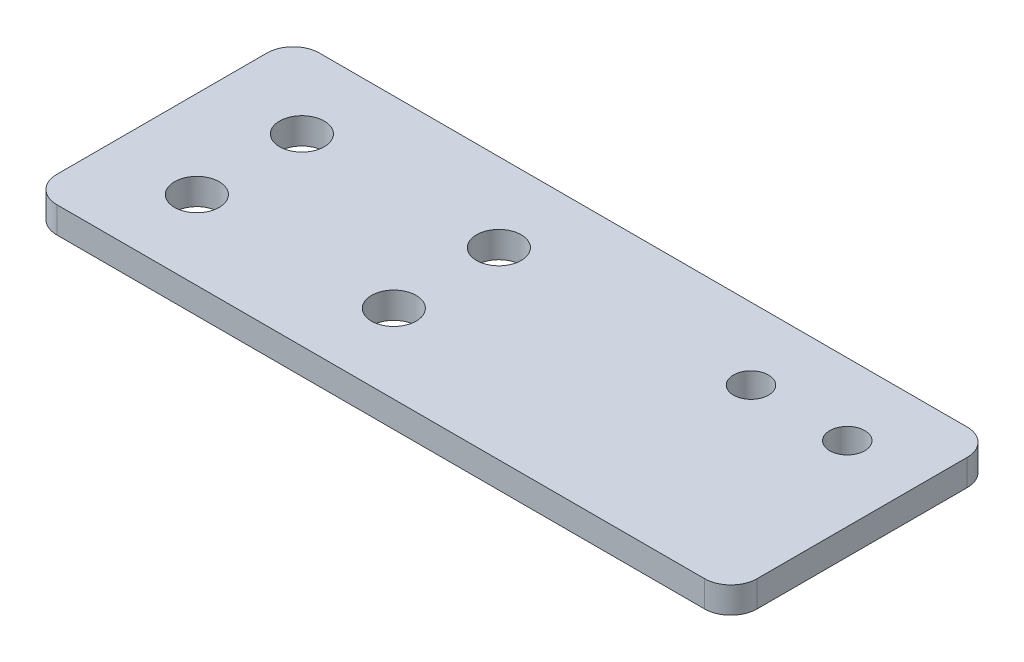
ISO-10303-21;
HEADER;
FILE_DESCRIPTION(('STEP AP214'),'2;1');
FILE_NAME('part.step','',(''),(''),'','','');
FILE_SCHEMA(('AUTOMOTIVE_DESIGN { 1 0 10303 214 1 1 1 1 }'));
ENDSEC;
DATA;
#1=APPLICATION_CONTEXT('core data for automotive mechanical design processes');
#2=APPLICATION_PROTOCOL_DEFINITION('international standard','automotive_design',2000,#1);
#3=PRODUCT_CONTEXT('',#1,'mechanical');
#4=PRODUCT('Part','Part','',(#3));
#5=PRODUCT_RELATED_PRODUCT_CATEGORY('part','',(#4));
#6=PRODUCT_DEFINITION_FORMATION('','',#4);
#7=PRODUCT_DEFINITION_CONTEXT('part definition',#1,'design');
#8=PRODUCT_DEFINITION('design','',#6,#7);
#9=PRODUCT_DEFINITION_SHAPE('','',#8);
#10=(LENGTH_UNIT() NAMED_UNIT(*) SI_UNIT(.MILLI.,.METRE.));
#11=(NAMED_UNIT(*) PLANE_ANGLE_UNIT() SI_UNIT($,.RADIAN.));
#12=(NAMED_UNIT(*) SI_UNIT($,.STERADIAN.) SOLID_ANGLE_UNIT());
#13=UNCERTAINTY_MEASURE_WITH_UNIT(LENGTH_MEASURE(1.E-05),#10,'distance_accuracy_value','');
#14=(GEOMETRIC_REPRESENTATION_CONTEXT(3) GLOBAL_UNCERTAINTY_ASSIGNED_CONTEXT((#13)) GLOBAL_UNIT_ASSIGNED_CONTEXT((#10,
#11,#12)) REPRESENTATION_CONTEXT('',''));
#15=CARTESIAN_POINT('',(0.,0.,0.));
#16=DIRECTION('',(0.,0.,1.));
#17=DIRECTION('',(1.,0.,0.));
#18=AXIS2_PLACEMENT_3D('',#15,#16,#17);
#19=CARTESIAN_POINT('',(37.,3.,-12.));
#20=DIRECTION('',(0.,1.,0.));
#21=DIRECTION('',(0.,0.,1.));
#22=AXIS2_PLACEMENT_3D('',#19,#20,#21);
#23=PLANE('',#22);
#24=CARTESIAN_POINT('',(-7.49999999999997,3.,-6.));
#25=DIRECTION('',(0.,1.,0.));
#26=DIRECTION('',(0.,0.,1.));
#27=AXIS2_PLACEMENT_3D('',#24,#25,#26);
#28=CIRCLE('',#27,2.55);
#29=CARTESIAN_POINT('',(-7.49999999999997,3.,-3.45));
#30=VERTEX_POINT('',#29);
#31=EDGE_CURVE('E202',#30,#30,#28,.T.);
#32=ORIENTED_EDGE('',*,*,#31,.F.);
#33=EDGE_LOOP('',(#32));
#34=FACE_BOUND('',#33,.T.);
#35=CARTESIAN_POINT('',(-30.,3.,-6.));
#36=DIRECTION('',(0.,1.,0.));
#37=DIRECTION('',(0.,0.,1.));
#38=AXIS2_PLACEMENT_3D('',#35,#36,#37);
#39=CIRCLE('',#38,2.55);
#40=CARTESIAN_POINT('',(-30.,3.,-3.45));
#41=VERTEX_POINT('',#40);
#42=EDGE_CURVE('E190',#41,#41,#39,.T.);
#43=ORIENTED_EDGE('',*,*,#42,.F.);
#44=EDGE_LOOP('',(#43));
#45=FACE_BOUND('',#44,.T.);
#46=CARTESIAN_POINT('',(20.5,3.,-6.8));
#47=DIRECTION('',(0.,1.,0.));
#48=DIRECTION('',(0.,0.,1.));
#49=AXIS2_PLACEMENT_3D('',#46,#47,#48);
#50=CIRCLE('',#49,2.);
#51=CARTESIAN_POINT('',(20.5,3.,-4.80000000000001));
#52=VERTEX_POINT('',#51);
#53=EDGE_CURVE('E136',#52,#52,#50,.T.);
#54=ORIENTED_EDGE('',*,*,#53,.F.);
#55=EDGE_LOOP('',(#54));
#56=FACE_BOUND('',#55,.T.);
#57=CARTESIAN_POINT('',(37.,3.,-12.));
#58=DIRECTION('',(0.,1.,0.));
#59=DIRECTION('',(0.,0.,1.));
#60=AXIS2_PLACEMENT_3D('',#57,#58,#59);
#61=CIRCLE('',#60,3.00000000000001);
#62=CARTESIAN_POINT('',(40.,3.,-12.));
#63=VERTEX_POINT('',#62);
#64=CARTESIAN_POINT('',(37.,3.,-15.));
#65=VERTEX_POINT('',#64);
#66=EDGE_CURVE('E147',#63,#65,#61,.T.);
#67=ORIENTED_EDGE('',*,*,#66,.T.);
#68=DIRECTION('',(-1.,0.,0.));
#69=VECTOR('',#68,1.);
#70=CARTESIAN_POINT('',(-37.,3.,-15.));
#71=LINE('',#70,#69);
#72=CARTESIAN_POINT('',(-37.,3.,-15.));
#73=VERTEX_POINT('',#72);
#74=EDGE_CURVE('E95',#65,#73,#71,.T.);
#75=ORIENTED_EDGE('',*,*,#74,.T.);
#76=CARTESIAN_POINT('',(-37.,3.,-12.));
#77=DIRECTION('',(0.,1.,0.));
#78=DIRECTION('',(0.,0.,-1.));
#79=AXIS2_PLACEMENT_3D('',#76,#77,#78);
#80=CIRCLE('',#79,3.);
#81=CARTESIAN_POINT('',(-40.,3.,-12.));
#82=VERTEX_POINT('',#81);
#83=EDGE_CURVE('E162',#73,#82,#80,.T.);
#84=ORIENTED_EDGE('',*,*,#83,.T.);
#85=DIRECTION('',(0.,0.,1.));
#86=VECTOR('',#85,1.);
#87=CARTESIAN_POINT('',(-40.,3.,-12.));
#88=LINE('',#87,#86);
#89=CARTESIAN_POINT('',(-40.,3.,12.));
#90=VERTEX_POINT('',#89);
#91=EDGE_CURVE('E175',#82,#90,#88,.T.);
#92=ORIENTED_EDGE('',*,*,#91,.T.);
#93=CARTESIAN_POINT('',(-37.,3.,12.));
#94=DIRECTION('',(0.,1.,0.));
#95=DIRECTION('',(0.,0.,-1.));
#96=AXIS2_PLACEMENT_3D('',#93,#94,#95);
#97=CIRCLE('',#96,3.);
#98=CARTESIAN_POINT('',(-37.,3.,15.));
#99=VERTEX_POINT('',#98);
#100=EDGE_CURVE('E114',#90,#99,#97,.T.);
#101=ORIENTED_EDGE('',*,*,#100,.T.);
#102=DIRECTION('',(1.,0.,0.));
#103=VECTOR('',#102,1.);
#104=CARTESIAN_POINT('',(-37.,3.,15.));
#105=LINE('',#104,#103);
#106=CARTESIAN_POINT('',(37.,3.,15.));
#107=VERTEX_POINT('',#106);
#108=EDGE_CURVE('E108',#99,#107,#105,.T.);
#109=ORIENTED_EDGE('',*,*,#108,.T.);
#110=CARTESIAN_POINT('',(37.,3.,12.));
#111=DIRECTION('',(0.,1.,0.));
#112=DIRECTION('',(0.,0.,1.));
#113=AXIS2_PLACEMENT_3D('',#110,#111,#112);
#114=CIRCLE('',#113,3.00000000000001);
#115=CARTESIAN_POINT('',(40.,3.,12.));
#116=VERTEX_POINT('',#115);
#117=EDGE_CURVE('E112',#107,#116,#114,.T.);
#118=ORIENTED_EDGE('',*,*,#117,.T.);
#119=DIRECTION('',(0.,0.,-1.));
#120=VECTOR('',#119,1.);
#121=CARTESIAN_POINT('',(40.,3.,-12.));
#122=LINE('',#121,#120);
#123=EDGE_CURVE('E52',#116,#63,#122,.T.);
#124=ORIENTED_EDGE('',*,*,#123,.T.);
#125=EDGE_LOOP('',(#67,#75,#84,#92,#101,#109,#118,#124));
#126=FACE_BOUND('',#125,.T.);
#127=CARTESIAN_POINT('',(31.5,3.,-6.8));
#128=DIRECTION('',(0.,1.,0.));
#129=DIRECTION('',(0.,0.,1.));
#130=AXIS2_PLACEMENT_3D('',#127,#128,#129);
#131=CIRCLE('',#130,2.);
#132=CARTESIAN_POINT('',(31.5,3.,-4.80000000000001));
#133=VERTEX_POINT('',#132);
#134=EDGE_CURVE('E184',#133,#133,#131,.T.);
#135=ORIENTED_EDGE('',*,*,#134,.F.);
#136=EDGE_LOOP('',(#135));
#137=FACE_BOUND('',#136,.T.);
#138=CARTESIAN_POINT('',(-29.9999999999998,3.,6.));
#139=DIRECTION('',(0.,1.,0.));
#140=DIRECTION('',(0.,0.,1.));
#141=AXIS2_PLACEMENT_3D('',#138,#139,#140);
#142=CIRCLE('',#141,2.55);
#143=CARTESIAN_POINT('',(-29.9999999999998,3.,8.55));
#144=VERTEX_POINT('',#143);
#145=EDGE_CURVE('E196',#144,#144,#142,.T.);
#146=ORIENTED_EDGE('',*,*,#145,.F.);
#147=EDGE_LOOP('',(#146));
#148=FACE_BOUND('',#147,.T.);
#149=CARTESIAN_POINT('',(-7.49999999999985,3.,6.));
#150=DIRECTION('',(0.,1.,0.));
#151=DIRECTION('',(0.,0.,1.));
#152=AXIS2_PLACEMENT_3D('',#149,#150,#151);
#153=CIRCLE('',#152,2.55);
#154=CARTESIAN_POINT('',(-7.49999999999985,3.,8.55));
#155=VERTEX_POINT('',#154);
#156=EDGE_CURVE('E208',#155,#155,#153,.T.);
#157=ORIENTED_EDGE('',*,*,#156,.F.);
#158=EDGE_LOOP('',(#157));
#159=FACE_BOUND('',#158,.T.);
#160=ADVANCED_FACE('F35',(#34,#45,#56,#126,#137,#148,#159),#23,.T.);
#161=CARTESIAN_POINT('',(37.,0.,-12.));
#162=DIRECTION('',(0.,1.,0.));
#163=DIRECTION('',(0.,0.,1.));
#164=AXIS2_PLACEMENT_3D('',#161,#162,#163);
#165=PLANE('',#164);
#166=CARTESIAN_POINT('',(37.,0.,-12.));
#167=DIRECTION('',(0.,1.,0.));
#168=DIRECTION('',(0.,0.,1.));
#169=AXIS2_PLACEMENT_3D('',#166,#167,#168);
#170=CIRCLE('',#169,3.00000000000001);
#171=CARTESIAN_POINT('',(40.,0.,-12.));
#172=VERTEX_POINT('',#171);
#173=CARTESIAN_POINT('',(37.,0.,-15.));
#174=VERTEX_POINT('',#173);
#175=EDGE_CURVE('E132',#172,#174,#170,.T.);
#176=ORIENTED_EDGE('',*,*,#175,.F.);
#177=DIRECTION('',(0.,0.,-1.));
#178=VECTOR('',#177,1.);
#179=CARTESIAN_POINT('',(40.,0.,-12.));
#180=LINE('',#179,#178);
#181=CARTESIAN_POINT('',(40.,0.,12.));
#182=VERTEX_POINT('',#181);
#183=EDGE_CURVE('E87',#182,#172,#180,.T.);
#184=ORIENTED_EDGE('',*,*,#183,.F.);
#185=CARTESIAN_POINT('',(37.,0.,12.));
#186=DIRECTION('',(0.,1.,0.));
#187=DIRECTION('',(0.,0.,1.));
#188=AXIS2_PLACEMENT_3D('',#185,#186,#187);
#189=CIRCLE('',#188,3.00000000000001);
#190=CARTESIAN_POINT('',(37.,0.,15.));
#191=VERTEX_POINT('',#190);
#192=EDGE_CURVE('E81',#191,#182,#189,.T.);
#193=ORIENTED_EDGE('',*,*,#192,.F.);
#194=DIRECTION('',(1.,0.,0.));
#195=VECTOR('',#194,1.);
#196=CARTESIAN_POINT('',(-37.,0.,15.));
#197=LINE('',#196,#195);
#198=CARTESIAN_POINT('',(-37.,0.,15.));
#199=VERTEX_POINT('',#198);
#200=EDGE_CURVE('E122',#199,#191,#197,.T.);
#201=ORIENTED_EDGE('',*,*,#200,.F.);
#202=CARTESIAN_POINT('',(-37.,0.,12.));
#203=DIRECTION('',(0.,1.,0.));
#204=DIRECTION('',(0.,0.,-1.));
#205=AXIS2_PLACEMENT_3D('',#202,#203,#204);
#206=CIRCLE('',#205,3.);
#207=CARTESIAN_POINT('',(-40.,0.,12.));
#208=VERTEX_POINT('',#207);
#209=EDGE_CURVE('E142',#208,#199,#206,.T.);
#210=ORIENTED_EDGE('',*,*,#209,.F.);
#211=DIRECTION('',(0.,0.,1.));
#212=VECTOR('',#211,1.);
#213=CARTESIAN_POINT('',(-40.,0.,-12.));
#214=LINE('',#213,#212);
#215=CARTESIAN_POINT('',(-40.,0.,-12.));
#216=VERTEX_POINT('',#215);
#217=EDGE_CURVE('E140',#216,#208,#214,.T.);
#218=ORIENTED_EDGE('',*,*,#217,.F.);
#219=CARTESIAN_POINT('',(-37.,0.,-12.));
#220=DIRECTION('',(0.,1.,0.));
#221=DIRECTION('',(0.,0.,-1.));
#222=AXIS2_PLACEMENT_3D('',#219,#220,#221);
#223=CIRCLE('',#222,3.);
#224=CARTESIAN_POINT('',(-37.,0.,-15.));
#225=VERTEX_POINT('',#224);
#226=EDGE_CURVE('E138',#225,#216,#223,.T.);
#227=ORIENTED_EDGE('',*,*,#226,.F.);
#228=DIRECTION('',(-1.,0.,0.));
#229=VECTOR('',#228,1.);
#230=CARTESIAN_POINT('',(-37.,0.,-15.));
#231=LINE('',#230,#229);
#232=EDGE_CURVE('E135',#174,#225,#231,.T.);
#233=ORIENTED_EDGE('',*,*,#232,.F.);
#234=EDGE_LOOP('',(#176,#184,#193,#201,#210,#218,#227,#233));
#235=FACE_BOUND('',#234,.T.);
#236=CARTESIAN_POINT('',(20.5,0.,-6.8));
#237=DIRECTION('',(0.,1.,0.));
#238=DIRECTION('',(0.,0.,1.));
#239=AXIS2_PLACEMENT_3D('',#236,#237,#238);
#240=CIRCLE('',#239,2.);
#241=CARTESIAN_POINT('',(20.5,0.,-4.80000000000001));
#242=VERTEX_POINT('',#241);
#243=EDGE_CURVE('E181',#242,#242,#240,.T.);
#244=ORIENTED_EDGE('',*,*,#243,.T.);
#245=EDGE_LOOP('',(#244));
#246=FACE_BOUND('',#245,.T.);
#247=CARTESIAN_POINT('',(31.5,0.,-6.8));
#248=DIRECTION('',(0.,1.,0.));
#249=DIRECTION('',(0.,0.,1.));
#250=AXIS2_PLACEMENT_3D('',#247,#248,#249);
#251=CIRCLE('',#250,2.);
#252=CARTESIAN_POINT('',(31.5,0.,-4.80000000000001));
#253=VERTEX_POINT('',#252);
#254=EDGE_CURVE('E187',#253,#253,#251,.T.);
#255=ORIENTED_EDGE('',*,*,#254,.T.);
#256=EDGE_LOOP('',(#255));
#257=FACE_BOUND('',#256,.T.);
#258=CARTESIAN_POINT('',(-30.,0.,-6.));
#259=DIRECTION('',(0.,1.,0.));
#260=DIRECTION('',(0.,0.,1.));
#261=AXIS2_PLACEMENT_3D('',#258,#259,#260);
#262=CIRCLE('',#261,2.55);
#263=CARTESIAN_POINT('',(-30.,0.,-3.45));
#264=VERTEX_POINT('',#263);
#265=EDGE_CURVE('E193',#264,#264,#262,.T.);
#266=ORIENTED_EDGE('',*,*,#265,.T.);
#267=EDGE_LOOP('',(#266));
#268=FACE_BOUND('',#267,.T.);
#269=CARTESIAN_POINT('',(-29.9999999999998,0.,6.));
#270=DIRECTION('',(0.,1.,0.));
#271=DIRECTION('',(0.,0.,1.));
#272=AXIS2_PLACEMENT_3D('',#269,#270,#271);
#273=CIRCLE('',#272,2.55);
#274=CARTESIAN_POINT('',(-29.9999999999998,0.,8.55));
#275=VERTEX_POINT('',#274);
#276=EDGE_CURVE('E199',#275,#275,#273,.T.);
#277=ORIENTED_EDGE('',*,*,#276,.T.);
#278=EDGE_LOOP('',(#277));
#279=FACE_BOUND('',#278,.T.);
#280=CARTESIAN_POINT('',(-7.49999999999997,0.,-6.));
#281=DIRECTION('',(0.,1.,0.));
#282=DIRECTION('',(0.,0.,1.));
#283=AXIS2_PLACEMENT_3D('',#280,#281,#282);
#284=CIRCLE('',#283,2.55);
#285=CARTESIAN_POINT('',(-7.49999999999997,0.,-3.45));
#286=VERTEX_POINT('',#285);
#287=EDGE_CURVE('E205',#286,#286,#284,.T.);
#288=ORIENTED_EDGE('',*,*,#287,.T.);
#289=EDGE_LOOP('',(#288));
#290=FACE_BOUND('',#289,.T.);
#291=CARTESIAN_POINT('',(-7.49999999999985,0.,6.));
#292=DIRECTION('',(0.,1.,0.));
#293=DIRECTION('',(0.,0.,1.));
#294=AXIS2_PLACEMENT_3D('',#291,#292,#293);
#295=CIRCLE('',#294,2.55);
#296=CARTESIAN_POINT('',(-7.49999999999985,0.,8.55));
#297=VERTEX_POINT('',#296);
#298=EDGE_CURVE('E211',#297,#297,#295,.T.);
#299=ORIENTED_EDGE('',*,*,#298,.T.);
#300=EDGE_LOOP('',(#299));
#301=FACE_BOUND('',#300,.T.);
#302=ADVANCED_FACE('F166',(#235,#246,#257,#268,#279,#290,#301),#165,.F.);
#303=CARTESIAN_POINT('',(37.,3.,-12.));
#304=DIRECTION('',(0.,-1.,0.));
#305=DIRECTION('',(0.,0.,-1.));
#306=AXIS2_PLACEMENT_3D('',#303,#304,#305);
#307=CYLINDRICAL_SURFACE('',#306,3.00000000000001);
#308=ORIENTED_EDGE('',*,*,#175,.T.);
#309=DIRECTION('',(0.,-1.,0.));
#310=VECTOR('',#309,1.);
#311=CARTESIAN_POINT('',(37.,3.,-15.));
#312=LINE('',#311,#310);
#313=EDGE_CURVE('E11',#65,#174,#312,.T.);
#314=ORIENTED_EDGE('',*,*,#313,.F.);
#315=ORIENTED_EDGE('',*,*,#66,.F.);
#316=DIRECTION('',(0.,-1.,0.));
#317=VECTOR('',#316,1.);
#318=CARTESIAN_POINT('',(40.,3.,-12.));
#319=LINE('',#318,#317);
#320=EDGE_CURVE('E128',#63,#172,#319,.T.);
#321=ORIENTED_EDGE('',*,*,#320,.T.);
#322=EDGE_LOOP('',(#308,#314,#315,#321));
#323=FACE_BOUND('',#322,.T.);
#324=ADVANCED_FACE('F37',(#323),#307,.T.);
#325=CARTESIAN_POINT('',(-37.,3.,-15.));
#326=DIRECTION('',(0.,0.,1.));
#327=DIRECTION('',(1.,0.,0.));
#328=AXIS2_PLACEMENT_3D('',#325,#326,#327);
#329=PLANE('',#328);
#330=ORIENTED_EDGE('',*,*,#232,.T.);
#331=DIRECTION('',(0.,-1.,0.));
#332=VECTOR('',#331,1.);
#333=CARTESIAN_POINT('',(-37.,3.,-15.));
#334=LINE('',#333,#332);
#335=EDGE_CURVE('E44',#73,#225,#334,.T.);
#336=ORIENTED_EDGE('',*,*,#335,.F.);
#337=ORIENTED_EDGE('',*,*,#74,.F.);
#338=ORIENTED_EDGE('',*,*,#313,.T.);
#339=EDGE_LOOP('',(#330,#336,#337,#338));
#340=FACE_BOUND('',#339,.T.);
#341=ADVANCED_FACE('F245',(#340),#329,.F.);
#342=CARTESIAN_POINT('',(-37.,3.,-12.));
#343=DIRECTION('',(0.,-1.,0.));
#344=DIRECTION('',(0.,0.,-1.));
#345=AXIS2_PLACEMENT_3D('',#342,#343,#344);
#346=CYLINDRICAL_SURFACE('',#345,3.);
#347=ORIENTED_EDGE('',*,*,#226,.T.);
#348=DIRECTION('',(0.,-1.,0.));
#349=VECTOR('',#348,1.);
#350=CARTESIAN_POINT('',(-40.,3.,-12.));
#351=LINE('',#350,#349);
#352=EDGE_CURVE('E154',#82,#216,#351,.T.);
#353=ORIENTED_EDGE('',*,*,#352,.F.);
#354=ORIENTED_EDGE('',*,*,#83,.F.);
#355=ORIENTED_EDGE('',*,*,#335,.T.);
#356=EDGE_LOOP('',(#347,#353,#354,#355));
#357=FACE_BOUND('',#356,.T.);
#358=ADVANCED_FACE('F160',(#357),#346,.T.);
#359=CARTESIAN_POINT('',(-40.,3.,-12.));
#360=DIRECTION('',(1.,0.,0.));
#361=DIRECTION('',(0.,0.,-1.));
#362=AXIS2_PLACEMENT_3D('',#359,#360,#361);
#363=PLANE('',#362);
#364=ORIENTED_EDGE('',*,*,#217,.T.);
#365=DIRECTION('',(0.,-1.,0.));
#366=VECTOR('',#365,1.);
#367=CARTESIAN_POINT('',(-40.,3.,12.));
#368=LINE('',#367,#366);
#369=EDGE_CURVE('E151',#90,#208,#368,.T.);
#370=ORIENTED_EDGE('',*,*,#369,.F.);
#371=ORIENTED_EDGE('',*,*,#91,.F.);
#372=ORIENTED_EDGE('',*,*,#352,.T.);
#373=EDGE_LOOP('',(#364,#370,#371,#372));
#374=FACE_BOUND('',#373,.T.);
#375=ADVANCED_FACE('F171',(#374),#363,.F.);
#376=CARTESIAN_POINT('',(-37.,3.,12.));
#377=DIRECTION('',(0.,-1.,0.));
#378=DIRECTION('',(0.,0.,-1.));
#379=AXIS2_PLACEMENT_3D('',#376,#377,#378);
#380=CYLINDRICAL_SURFACE('',#379,3.);
#381=ORIENTED_EDGE('',*,*,#209,.T.);
#382=DIRECTION('',(0.,-1.,0.));
#383=VECTOR('',#382,1.);
#384=CARTESIAN_POINT('',(-37.,3.,15.));
#385=LINE('',#384,#383);
#386=EDGE_CURVE('E123',#99,#199,#385,.T.);
#387=ORIENTED_EDGE('',*,*,#386,.F.);
#388=ORIENTED_EDGE('',*,*,#100,.F.);
#389=ORIENTED_EDGE('',*,*,#369,.T.);
#390=EDGE_LOOP('',(#381,#387,#388,#389));
#391=FACE_BOUND('',#390,.T.);
#392=ADVANCED_FACE('F174',(#391),#380,.T.);
#393=CARTESIAN_POINT('',(-37.,3.,15.));
#394=DIRECTION('',(0.,0.,-1.));
#395=DIRECTION('',(-1.,0.,0.));
#396=AXIS2_PLACEMENT_3D('',#393,#394,#395);
#397=PLANE('',#396);
#398=ORIENTED_EDGE('',*,*,#200,.T.);
#399=DIRECTION('',(0.,-1.,0.));
#400=VECTOR('',#399,1.);
#401=CARTESIAN_POINT('',(37.,3.,15.));
#402=LINE('',#401,#400);
#403=EDGE_CURVE('E119',#107,#191,#402,.T.);
#404=ORIENTED_EDGE('',*,*,#403,.F.);
#405=ORIENTED_EDGE('',*,*,#108,.F.);
#406=ORIENTED_EDGE('',*,*,#386,.T.);
#407=EDGE_LOOP('',(#398,#404,#405,#406));
#408=FACE_BOUND('',#407,.T.);
#409=ADVANCED_FACE('F120',(#408),#397,.F.);
#410=CARTESIAN_POINT('',(37.,3.,12.));
#411=DIRECTION('',(0.,-1.,0.));
#412=DIRECTION('',(0.,0.,-1.));
#413=AXIS2_PLACEMENT_3D('',#410,#411,#412);
#414=CYLINDRICAL_SURFACE('',#413,3.00000000000001);
#415=ORIENTED_EDGE('',*,*,#192,.T.);
#416=DIRECTION('',(0.,-1.,0.));
#417=VECTOR('',#416,1.);
#418=CARTESIAN_POINT('',(40.,3.,12.));
#419=LINE('',#418,#417);
#420=EDGE_CURVE('E124',#116,#182,#419,.T.);
#421=ORIENTED_EDGE('',*,*,#420,.F.);
#422=ORIENTED_EDGE('',*,*,#117,.F.);
#423=ORIENTED_EDGE('',*,*,#403,.T.);
#424=EDGE_LOOP('',(#415,#421,#422,#423));
#425=FACE_BOUND('',#424,.T.);
#426=ADVANCED_FACE('F126',(#425),#414,.T.);
#427=CARTESIAN_POINT('',(40.,3.,-12.));
#428=DIRECTION('',(-1.,0.,0.));
#429=DIRECTION('',(0.,0.,1.));
#430=AXIS2_PLACEMENT_3D('',#427,#428,#429);
#431=PLANE('',#430);
#432=ORIENTED_EDGE('',*,*,#183,.T.);
#433=ORIENTED_EDGE('',*,*,#320,.F.);
#434=ORIENTED_EDGE('',*,*,#123,.F.);
#435=ORIENTED_EDGE('',*,*,#420,.T.);
#436=EDGE_LOOP('',(#432,#433,#434,#435));
#437=FACE_BOUND('',#436,.T.);
#438=ADVANCED_FACE('F233',(#437),#431,.F.);
#439=CARTESIAN_POINT('',(20.5,3.,-6.8));
#440=DIRECTION('',(0.,-1.,0.));
#441=DIRECTION('',(0.,0.,-1.));
#442=AXIS2_PLACEMENT_3D('',#439,#440,#441);
#443=CYLINDRICAL_SURFACE('',#442,2.);
#444=ORIENTED_EDGE('',*,*,#53,.T.);
#445=EDGE_LOOP('',(#444));
#446=FACE_BOUND('',#445,.T.);
#447=ORIENTED_EDGE('',*,*,#243,.F.);
#448=EDGE_LOOP('',(#447));
#449=FACE_BOUND('',#448,.T.);
#450=ADVANCED_FACE('F230',(#446,#449),#443,.F.);
#451=CARTESIAN_POINT('',(31.5,3.,-6.8));
#452=DIRECTION('',(0.,-1.,0.));
#453=DIRECTION('',(0.,0.,-1.));
#454=AXIS2_PLACEMENT_3D('',#451,#452,#453);
#455=CYLINDRICAL_SURFACE('',#454,2.);
#456=ORIENTED_EDGE('',*,*,#134,.T.);
#457=EDGE_LOOP('',(#456));
#458=FACE_BOUND('',#457,.T.);
#459=ORIENTED_EDGE('',*,*,#254,.F.);
#460=EDGE_LOOP('',(#459));
#461=FACE_BOUND('',#460,.T.);
#462=ADVANCED_FACE('F309',(#458,#461),#455,.F.);
#463=CARTESIAN_POINT('',(-30.,3.,-6.));
#464=DIRECTION('',(0.,-1.,0.));
#465=DIRECTION('',(0.,0.,-1.));
#466=AXIS2_PLACEMENT_3D('',#463,#464,#465);
#467=CYLINDRICAL_SURFACE('',#466,2.55);
#468=ORIENTED_EDGE('',*,*,#42,.T.);
#469=EDGE_LOOP('',(#468));
#470=FACE_BOUND('',#469,.T.);
#471=ORIENTED_EDGE('',*,*,#265,.F.);
#472=EDGE_LOOP('',(#471));
#473=FACE_BOUND('',#472,.T.);
#474=ADVANCED_FACE('F317',(#470,#473),#467,.F.);
#475=CARTESIAN_POINT('',(-29.9999999999998,3.,6.));
#476=DIRECTION('',(0.,-1.,0.));
#477=DIRECTION('',(0.,0.,-1.));
#478=AXIS2_PLACEMENT_3D('',#475,#476,#477);
#479=CYLINDRICAL_SURFACE('',#478,2.55);
#480=ORIENTED_EDGE('',*,*,#145,.T.);
#481=EDGE_LOOP('',(#480));
#482=FACE_BOUND('',#481,.T.);
#483=ORIENTED_EDGE('',*,*,#276,.F.);
#484=EDGE_LOOP('',(#483));
#485=FACE_BOUND('',#484,.T.);
#486=ADVANCED_FACE('F325',(#482,#485),#479,.F.);
#487=CARTESIAN_POINT('',(-7.49999999999997,3.,-6.));
#488=DIRECTION('',(0.,-1.,0.));
#489=DIRECTION('',(0.,0.,-1.));
#490=AXIS2_PLACEMENT_3D('',#487,#488,#489);
#491=CYLINDRICAL_SURFACE('',#490,2.55);
#492=ORIENTED_EDGE('',*,*,#31,.T.);
#493=EDGE_LOOP('',(#492));
#494=FACE_BOUND('',#493,.T.);
#495=ORIENTED_EDGE('',*,*,#287,.F.);
#496=EDGE_LOOP('',(#495));
#497=FACE_BOUND('',#496,.T.);
#498=ADVANCED_FACE('F334',(#494,#497),#491,.F.);
#499=CARTESIAN_POINT('',(-7.49999999999985,3.,6.));
#500=DIRECTION('',(0.,-1.,0.));
#501=DIRECTION('',(0.,0.,-1.));
#502=AXIS2_PLACEMENT_3D('',#499,#500,#501);
#503=CYLINDRICAL_SURFACE('',#502,2.55);
#504=ORIENTED_EDGE('',*,*,#156,.T.);
#505=EDGE_LOOP('',(#504));
#506=FACE_BOUND('',#505,.T.);
#507=ORIENTED_EDGE('',*,*,#298,.F.);
#508=EDGE_LOOP('',(#507));
#509=FACE_BOUND('',#508,.T.);
#510=ADVANCED_FACE('F217',(#506,#509),#503,.F.);
#511=CLOSED_SHELL('',(#160,#302,#324,#341,#358,#375,#392,#409,#426,#438,#450,#462,#474,#486,
#498,#510));
#512=MANIFOLD_SOLID_BREP('B2',#511);
#513=ADVANCED_BREP_SHAPE_REPRESENTATION('',(#18,#512),#14);
#514=SHAPE_DEFINITION_REPRESENTATION(#9,#513);
ENDSEC;
END-ISO-10303-21;
